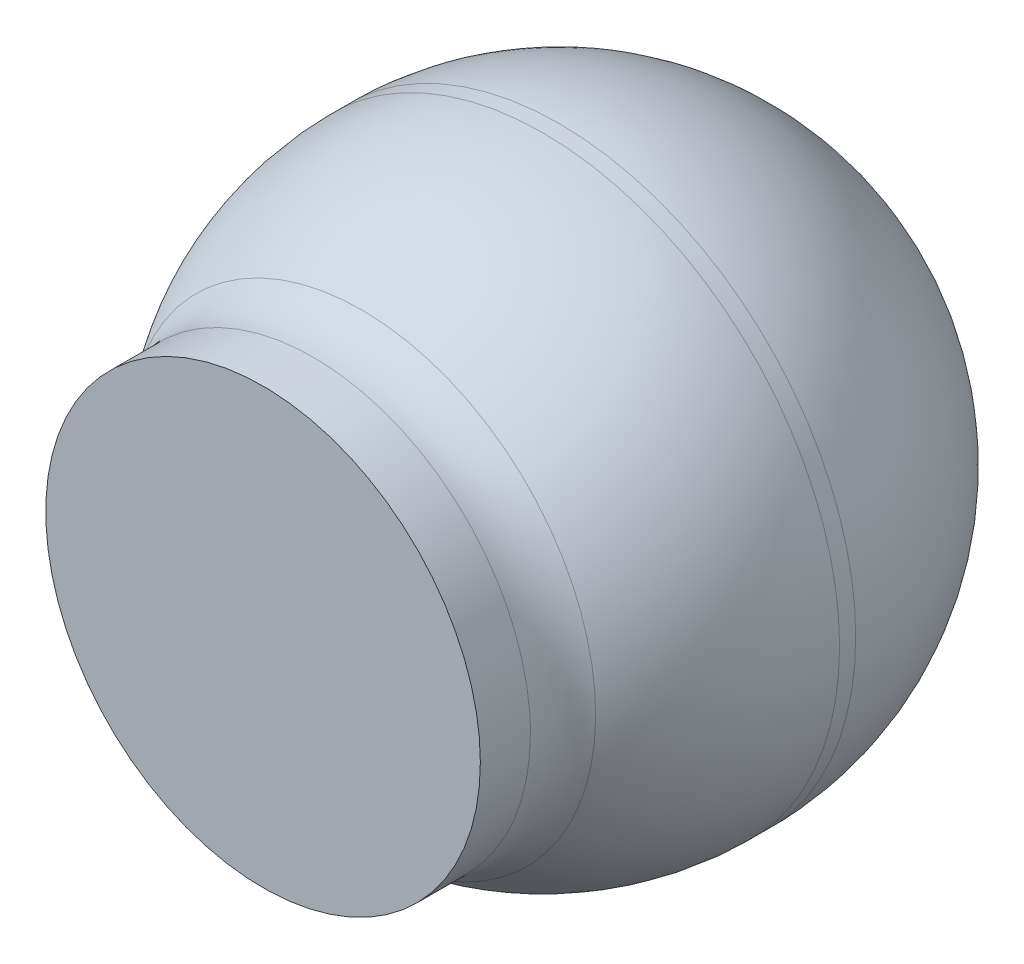
ISO-10303-21;
HEADER;
FILE_DESCRIPTION(('STEP AP214'),'2;1');
FILE_NAME('part.step','',(''),(''),'','','');
FILE_SCHEMA(('AUTOMOTIVE_DESIGN { 1 0 10303 214 1 1 1 1 }'));
ENDSEC;
DATA;
#1=APPLICATION_CONTEXT('core data for automotive mechanical design processes');
#2=APPLICATION_PROTOCOL_DEFINITION('international standard','automotive_design',2000,#1);
#3=PRODUCT_CONTEXT('',#1,'mechanical');
#4=PRODUCT('Part','Part','',(#3));
#5=PRODUCT_RELATED_PRODUCT_CATEGORY('part','',(#4));
#6=PRODUCT_DEFINITION_FORMATION('','',#4);
#7=PRODUCT_DEFINITION_CONTEXT('part definition',#1,'design');
#8=PRODUCT_DEFINITION('design','',#6,#7);
#9=PRODUCT_DEFINITION_SHAPE('','',#8);
#10=(LENGTH_UNIT() NAMED_UNIT(*) SI_UNIT(.MILLI.,.METRE.));
#11=(NAMED_UNIT(*) PLANE_ANGLE_UNIT() SI_UNIT($,.RADIAN.));
#12=(NAMED_UNIT(*) SI_UNIT($,.STERADIAN.) SOLID_ANGLE_UNIT());
#13=UNCERTAINTY_MEASURE_WITH_UNIT(LENGTH_MEASURE(1.E-05),#10,'distance_accuracy_value','');
#14=(GEOMETRIC_REPRESENTATION_CONTEXT(3) GLOBAL_UNCERTAINTY_ASSIGNED_CONTEXT((#13)) GLOBAL_UNIT_ASSIGNED_CONTEXT((#10,
#11,#12)) REPRESENTATION_CONTEXT('',''));
#15=CARTESIAN_POINT('',(0.,0.,0.));
#16=DIRECTION('',(0.,0.,1.));
#17=DIRECTION('',(1.,0.,0.));
#18=AXIS2_PLACEMENT_3D('',#15,#16,#17);
#19=CARTESIAN_POINT('',(-0.562919922269,-6.591349291452,10.006534503384));
#20=DIRECTION('',(0.,0.,-1.));
#21=DIRECTION('',(-1.,0.,0.));
#22=AXIS2_PLACEMENT_3D('',#19,#20,#21);
#23=PLANE('',#22);
#24=CARTESIAN_POINT('',(-0.562919922269,-6.591349291452,10.006534503384));
#25=DIRECTION('',(0.,0.,1.));
#26=DIRECTION('',(1.,0.,0.));
#27=AXIS2_PLACEMENT_3D('',#24,#25,#26);
#28=CIRCLE('',#27,0.275);
#29=CARTESIAN_POINT('',(-0.287919922269,-6.591349291452,10.006534503384));
#30=VERTEX_POINT('',#29);
#31=EDGE_CURVE('E20',#30,#30,#28,.F.);
#32=ORIENTED_EDGE('',*,*,#31,.F.);
#33=EDGE_LOOP('',(#32));
#34=FACE_BOUND('',#33,.T.);
#35=ADVANCED_FACE('F17',(#34),#23,.F.);
#36=CARTESIAN_POINT('',(-0.562919922269,-6.591349291452,9.906534503384));
#37=DIRECTION('',(0.,0.,1.));
#38=DIRECTION('',(1.,0.,0.));
#39=AXIS2_PLACEMENT_3D('',#36,#37,#38);
#40=CYLINDRICAL_SURFACE('',#39,0.275);
#41=CARTESIAN_POINT('',(-0.562919922269,-6.591349291452,9.943180457728));
#42=DIRECTION('',(0.,0.,-1.));
#43=DIRECTION('',(0.996700902337583,0.0811622527992438,0.));
#44=AXIS2_PLACEMENT_3D('',#41,#42,#43);
#45=CIRCLE('',#44,0.275);
#46=CARTESIAN_POINT('',(-0.288827174126165,-6.56902967193221,9.943180457728));
#47=VERTEX_POINT('',#46);
#48=EDGE_CURVE('E65',#47,#47,#45,.F.);
#49=ORIENTED_EDGE('',*,*,#48,.T.);
#50=EDGE_LOOP('',(#49));
#51=FACE_BOUND('',#50,.T.);
#52=ORIENTED_EDGE('',*,*,#31,.T.);
#53=EDGE_LOOP('',(#52));
#54=FACE_BOUND('',#53,.T.);
#55=ADVANCED_FACE('F62',(#51,#54),#40,.T.);
#56=CARTESIAN_POINT('',(-0.562919922269,-6.591349291452,9.943180457728));
#57=DIRECTION('',(0.,0.,-1.));
#58=DIRECTION('',(0.996700902337583,0.0811622527992449,0.));
#59=AXIS2_PLACEMENT_3D('',#56,#57,#58);
#60=TOROIDAL_SURFACE('',#59,0.375,0.1);
#61=ORIENTED_EDGE('',*,*,#48,.F.);
#62=EDGE_LOOP('',(#61));
#63=FACE_BOUND('',#62,.T.);
#64=CARTESIAN_POINT('',(-0.562919922268999,-6.591349291452,9.881744931236));
#65=DIRECTION('',(0.,0.,-1.));
#66=DIRECTION('',(-0.996700902337598,-0.0811622527990593,0.));
#67=AXIS2_PLACEMENT_3D('',#64,#65,#66);
#68=CIRCLE('',#67,0.296097046412665);
#69=CARTESIAN_POINT('',(-0.858040115608,-6.615381194786,9.881744931236));
#70=VERTEX_POINT('',#69);
#71=EDGE_CURVE('E39',#70,#70,#68,.T.);
#72=ORIENTED_EDGE('',*,*,#71,.F.);
#73=EDGE_LOOP('',(#72));
#74=FACE_BOUND('',#73,.T.);
#75=ADVANCED_FACE('F57',(#63,#74),#60,.F.);
#76=CARTESIAN_POINT('',(-0.936682760645,-6.621785136252,9.651976062157));
#77=CARTESIAN_POINT('',(-0.936682760645,-6.621785136252,9.701461392103));
#78=CARTESIAN_POINT('',(-0.928526217348,-6.621120941579,9.750947004335));
#79=CARTESIAN_POINT('',(-0.912207085349,-6.619792059952,9.798626332798));
#80=CARTESIAN_POINT('',(-0.888341390838,-6.617848654938,9.842699544317));
#81=CARTESIAN_POINT('',(-0.858040115608,-6.615381194786,9.881744931236));
#82=(BOUNDED_CURVE() B_SPLINE_CURVE(5,(#76,#77,#78,#79,#80,#81),.UNSPECIFIED.,.F.,
.F.) B_SPLINE_CURVE_WITH_KNOTS((6,6),(0.,0.661568582165),
.UNSPECIFIED.) CURVE() GEOMETRIC_REPRESENTATION_ITEM() RATIONAL_B_SPLINE_CURVE((1.,1.,1.,1.,1.,1.)) REPRESENTATION_ITEM(''));
#83=CARTESIAN_POINT('',(-0.562919922269,-6.591349291452,9.651976062157));
#84=DIRECTION('',(0.,0.,-1.));
#85=AXIS1_PLACEMENT('',#83,#84);
#86=SURFACE_OF_REVOLUTION('',#82,#85);
#87=CARTESIAN_POINT('',(-0.562919922268999,-6.591349291452,9.651976062157));
#88=DIRECTION('',(0.,0.,1.));
#89=DIRECTION('',(1.,0.,0.));
#90=AXIS2_PLACEMENT_3D('',#87,#88,#89);
#91=CIRCLE('',#90,0.375);
#92=CARTESIAN_POINT('',(-0.187919922268999,-6.591349291452,9.651976062157));
#93=VERTEX_POINT('',#92);
#94=EDGE_CURVE('E36',#93,#93,#91,.F.);
#95=ORIENTED_EDGE('',*,*,#94,.F.);
#96=EDGE_LOOP('',(#95));
#97=FACE_BOUND('',#96,.T.);
#98=ORIENTED_EDGE('',*,*,#71,.T.);
#99=EDGE_LOOP('',(#98));
#100=FACE_BOUND('',#99,.T.);
#101=ADVANCED_FACE('F53',(#97,#100),#86,.F.);
#102=CARTESIAN_POINT('',(-0.562919922269,-6.591349291452,9.256534503384));
#103=DIRECTION('',(0.,0.,1.));
#104=DIRECTION('',(1.,0.,0.));
#105=AXIS2_PLACEMENT_3D('',#102,#103,#104);
#106=CYLINDRICAL_SURFACE('',#105,0.375);
#107=CARTESIAN_POINT('',(-0.562919922269,-6.591349291452,9.631534503384));
#108=DIRECTION('',(0.,0.,-1.));
#109=DIRECTION('',(0.0811622527992362,-0.996700902337583,0.));
#110=AXIS2_PLACEMENT_3D('',#107,#108,#109);
#111=CIRCLE('',#110,0.375);
#112=CARTESIAN_POINT('',(-0.532484077469286,-6.96511212982859,9.631534503384));
#113=VERTEX_POINT('',#112);
#114=CARTESIAN_POINT('',(-0.593355767068713,-6.21758645307541,9.631534503384));
#115=VERTEX_POINT('',#114);
#116=EDGE_CURVE('E11',#113,#115,#111,.T.);
#117=ORIENTED_EDGE('',*,*,#116,.F.);
#118=CARTESIAN_POINT('',(-0.562919922269,-6.591349291452,9.631534503384));
#119=DIRECTION('',(0.,0.,1.));
#120=DIRECTION('',(0.0811622527992359,-0.996700902337583,0.));
#121=AXIS2_PLACEMENT_3D('',#118,#119,#120);
#122=CIRCLE('',#121,0.375);
#123=EDGE_CURVE('E25',#115,#113,#122,.F.);
#124=ORIENTED_EDGE('',*,*,#123,.F.);
#125=EDGE_LOOP('',(#117,#124));
#126=FACE_BOUND('',#125,.T.);
#127=ORIENTED_EDGE('',*,*,#94,.T.);
#128=EDGE_LOOP('',(#127));
#129=FACE_BOUND('',#128,.T.);
#130=ADVANCED_FACE('F34',(#126,#129),#106,.T.);
#131=CARTESIAN_POINT('',(-0.562919922269,-6.591349291452,9.631534503384));
#132=DIRECTION('',(0.0811622527992361,-0.996700902337583,0.));
#133=DIRECTION('',(-0.996700902337583,-0.0811622527992361,0.));
#134=AXIS2_PLACEMENT_3D('',#131,#132,#133);
#135=SPHERICAL_SURFACE('',#134,0.375);
#136=ORIENTED_EDGE('',*,*,#123,.T.);
#137=ORIENTED_EDGE('',*,*,#116,.T.);
#138=EDGE_LOOP('',(#136,#137));
#139=FACE_BOUND('',#138,.T.);
#140=ADVANCED_FACE('F32',(#139),#135,.T.);
#141=CLOSED_SHELL('',(#35,#55,#75,#101,#130,#140));
#142=MANIFOLD_SOLID_BREP('B1',#141);
#143=ADVANCED_BREP_SHAPE_REPRESENTATION('',(#18,#142),#14);
#144=SHAPE_DEFINITION_REPRESENTATION(#9,#143);
ENDSEC;
END-ISO-10303-21;
